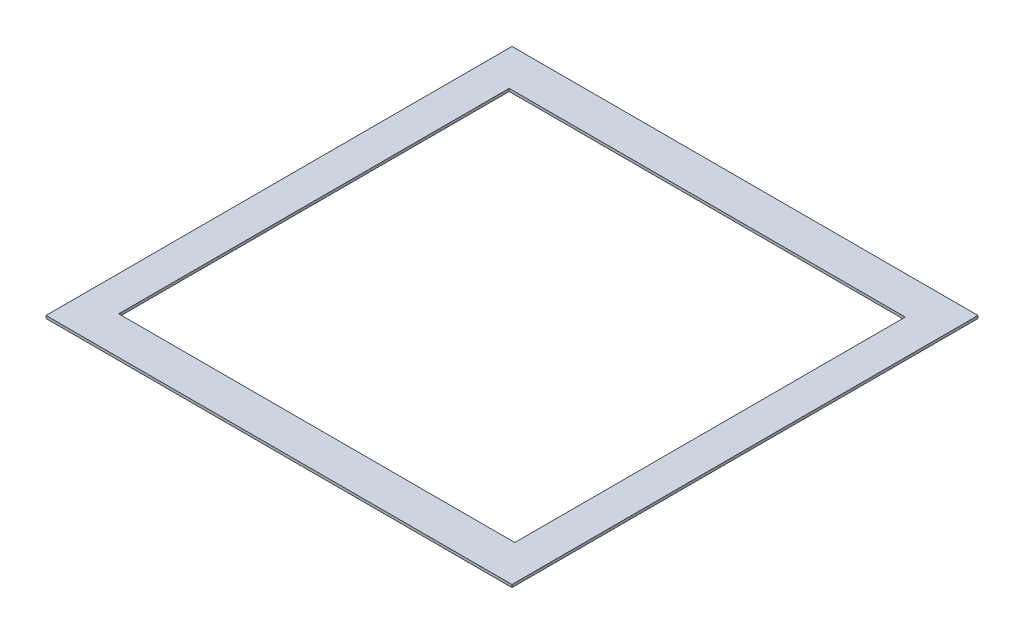
ISO-10303-21;
HEADER;
FILE_DESCRIPTION(('STEP AP214'),'2;1');
FILE_NAME('part.step','',(''),(''),'','','');
FILE_SCHEMA(('AUTOMOTIVE_DESIGN { 1 0 10303 214 1 1 1 1 }'));
ENDSEC;
DATA;
#1=APPLICATION_CONTEXT('core data for automotive mechanical design processes');
#2=APPLICATION_PROTOCOL_DEFINITION('international standard','automotive_design',2000,#1);
#3=PRODUCT_CONTEXT('',#1,'mechanical');
#4=PRODUCT('Part','Part','',(#3));
#5=PRODUCT_RELATED_PRODUCT_CATEGORY('part','',(#4));
#6=PRODUCT_DEFINITION_FORMATION('','',#4);
#7=PRODUCT_DEFINITION_CONTEXT('part definition',#1,'design');
#8=PRODUCT_DEFINITION('design','',#6,#7);
#9=PRODUCT_DEFINITION_SHAPE('','',#8);
#10=(LENGTH_UNIT() NAMED_UNIT(*) SI_UNIT(.MILLI.,.METRE.));
#11=(NAMED_UNIT(*) PLANE_ANGLE_UNIT() SI_UNIT($,.RADIAN.));
#12=(NAMED_UNIT(*) SI_UNIT($,.STERADIAN.) SOLID_ANGLE_UNIT());
#13=UNCERTAINTY_MEASURE_WITH_UNIT(LENGTH_MEASURE(1.E-05),#10,'distance_accuracy_value','');
#14=(GEOMETRIC_REPRESENTATION_CONTEXT(3) GLOBAL_UNCERTAINTY_ASSIGNED_CONTEXT((#13)) GLOBAL_UNIT_ASSIGNED_CONTEXT((#10,
#11,#12)) REPRESENTATION_CONTEXT('',''));
#15=CARTESIAN_POINT('',(0.,0.,0.));
#16=DIRECTION('',(0.,0.,1.));
#17=DIRECTION('',(1.,0.,0.));
#18=AXIS2_PLACEMENT_3D('',#15,#16,#17);
#19=CARTESIAN_POINT('',(0.,15.,0.));
#20=DIRECTION('',(0.,1.,0.));
#21=DIRECTION('',(0.,0.,1.));
#22=AXIS2_PLACEMENT_3D('',#19,#20,#21);
#23=PLANE('',#22);
#24=DIRECTION('',(0.,0.,-1.));
#25=VECTOR('',#24,1.);
#26=CARTESIAN_POINT('',(1278.51296885315,15.,-2321.24151416537));
#27=LINE('',#26,#25);
#28=CARTESIAN_POINT('',(1278.51296885315,15.,278.758485834634));
#29=VERTEX_POINT('',#28);
#30=CARTESIAN_POINT('',(1278.51296885315,15.,-2321.24151416537));
#31=VERTEX_POINT('',#30);
#32=EDGE_CURVE('E137',#29,#31,#27,.T.);
#33=ORIENTED_EDGE('',*,*,#32,.T.);
#34=DIRECTION('',(-1.,0.,0.));
#35=VECTOR('',#34,1.);
#36=CARTESIAN_POINT('',(-1321.48703114685,15.,-2321.24151416537));
#37=LINE('',#36,#35);
#38=CARTESIAN_POINT('',(-1321.48703114685,15.,-2321.24151416537));
#39=VERTEX_POINT('',#38);
#40=EDGE_CURVE('E140',#31,#39,#37,.T.);
#41=ORIENTED_EDGE('',*,*,#40,.T.);
#42=DIRECTION('',(0.,0.,1.));
#43=VECTOR('',#42,1.);
#44=CARTESIAN_POINT('',(-1321.48703114685,15.,-2321.24151416537));
#45=LINE('',#44,#43);
#46=CARTESIAN_POINT('',(-1321.48703114685,15.,278.758485834634));
#47=VERTEX_POINT('',#46);
#48=EDGE_CURVE('E143',#39,#47,#45,.T.);
#49=ORIENTED_EDGE('',*,*,#48,.T.);
#50=DIRECTION('',(1.,0.,0.));
#51=VECTOR('',#50,1.);
#52=CARTESIAN_POINT('',(-1321.48703114685,15.,278.758485834634));
#53=LINE('',#52,#51);
#54=EDGE_CURVE('E145',#47,#29,#53,.T.);
#55=ORIENTED_EDGE('',*,*,#54,.T.);
#56=EDGE_LOOP('',(#33,#41,#49,#55));
#57=FACE_BOUND('',#56,.T.);
#58=DIRECTION('',(1.,0.,0.));
#59=VECTOR('',#58,1.);
#60=CARTESIAN_POINT('',(1083.49575601553,15.,68.087029946589));
#61=LINE('',#60,#59);
#62=CARTESIAN_POINT('',(-1126.46981830923,15.,68.0870299465877));
#63=VERTEX_POINT('',#62);
#64=CARTESIAN_POINT('',(1083.49575601553,15.,68.087029946589));
#65=VERTEX_POINT('',#64);
#66=EDGE_CURVE('E109',#63,#65,#61,.T.);
#67=ORIENTED_EDGE('',*,*,#66,.F.);
#68=DIRECTION('',(0.,0.,1.));
#69=VECTOR('',#68,1.);
#70=CARTESIAN_POINT('',(-1126.46981830923,15.,68.0870299465877));
#71=LINE('',#70,#69);
#72=CARTESIAN_POINT('',(-1126.46981830923,15.,-2110.57005827732));
#73=VERTEX_POINT('',#72);
#74=EDGE_CURVE('E101',#73,#63,#71,.T.);
#75=ORIENTED_EDGE('',*,*,#74,.F.);
#76=DIRECTION('',(-1.,0.,0.));
#77=VECTOR('',#76,1.);
#78=CARTESIAN_POINT('',(-1126.46981830923,15.,-2110.57005827732));
#79=LINE('',#78,#77);
#80=CARTESIAN_POINT('',(1083.49575601553,15.,-2110.57005827732));
#81=VERTEX_POINT('',#80);
#82=EDGE_CURVE('E123',#81,#73,#79,.T.);
#83=ORIENTED_EDGE('',*,*,#82,.F.);
#84=DIRECTION('',(0.,0.,-1.));
#85=VECTOR('',#84,1.);
#86=CARTESIAN_POINT('',(1083.49575601553,15.,-2110.57005827732));
#87=LINE('',#86,#85);
#88=EDGE_CURVE('E121',#65,#81,#87,.T.);
#89=ORIENTED_EDGE('',*,*,#88,.F.);
#90=EDGE_LOOP('',(#67,#75,#83,#89));
#91=FACE_BOUND('',#90,.T.);
#92=ADVANCED_FACE('F36',(#57,#91),#23,.T.);
#93=CARTESIAN_POINT('',(0.,0.,0.));
#94=DIRECTION('',(0.,1.,0.));
#95=DIRECTION('',(0.,0.,1.));
#96=AXIS2_PLACEMENT_3D('',#93,#94,#95);
#97=PLANE('',#96);
#98=DIRECTION('',(0.,0.,-1.));
#99=VECTOR('',#98,1.);
#100=CARTESIAN_POINT('',(1278.51296885315,0.,-2321.24151416537));
#101=LINE('',#100,#99);
#102=CARTESIAN_POINT('',(1278.51296885315,0.,278.758485834634));
#103=VERTEX_POINT('',#102);
#104=CARTESIAN_POINT('',(1278.51296885315,0.,-2321.24151416537));
#105=VERTEX_POINT('',#104);
#106=EDGE_CURVE('E117',#103,#105,#101,.T.);
#107=ORIENTED_EDGE('',*,*,#106,.F.);
#108=DIRECTION('',(1.,0.,0.));
#109=VECTOR('',#108,1.);
#110=CARTESIAN_POINT('',(-1321.48703114685,0.,278.758485834634));
#111=LINE('',#110,#109);
#112=CARTESIAN_POINT('',(-1321.48703114685,0.,278.758485834634));
#113=VERTEX_POINT('',#112);
#114=EDGE_CURVE('E141',#113,#103,#111,.T.);
#115=ORIENTED_EDGE('',*,*,#114,.F.);
#116=DIRECTION('',(0.,0.,1.));
#117=VECTOR('',#116,1.);
#118=CARTESIAN_POINT('',(-1321.48703114685,0.,-2321.24151416537));
#119=LINE('',#118,#117);
#120=CARTESIAN_POINT('',(-1321.48703114685,0.,-2321.24151416537));
#121=VERTEX_POINT('',#120);
#122=EDGE_CURVE('E152',#121,#113,#119,.T.);
#123=ORIENTED_EDGE('',*,*,#122,.F.);
#124=DIRECTION('',(-1.,0.,0.));
#125=VECTOR('',#124,1.);
#126=CARTESIAN_POINT('',(-1321.48703114685,0.,-2321.24151416537));
#127=LINE('',#126,#125);
#128=EDGE_CURVE('E150',#105,#121,#127,.T.);
#129=ORIENTED_EDGE('',*,*,#128,.F.);
#130=EDGE_LOOP('',(#107,#115,#123,#129));
#131=FACE_BOUND('',#130,.T.);
#132=DIRECTION('',(0.,0.,1.));
#133=VECTOR('',#132,1.);
#134=CARTESIAN_POINT('',(-1126.46981830923,0.,68.0870299465877));
#135=LINE('',#134,#133);
#136=CARTESIAN_POINT('',(-1126.46981830923,0.,-2110.57005827732));
#137=VERTEX_POINT('',#136);
#138=CARTESIAN_POINT('',(-1126.46981830923,0.,68.0870299465877));
#139=VERTEX_POINT('',#138);
#140=EDGE_CURVE('E59',#137,#139,#135,.T.);
#141=ORIENTED_EDGE('',*,*,#140,.T.);
#142=DIRECTION('',(1.,0.,0.));
#143=VECTOR('',#142,1.);
#144=CARTESIAN_POINT('',(1083.49575601553,0.,68.087029946589));
#145=LINE('',#144,#143);
#146=CARTESIAN_POINT('',(1083.49575601553,0.,68.087029946589));
#147=VERTEX_POINT('',#146);
#148=EDGE_CURVE('E116',#139,#147,#145,.T.);
#149=ORIENTED_EDGE('',*,*,#148,.T.);
#150=DIRECTION('',(0.,0.,-1.));
#151=VECTOR('',#150,1.);
#152=CARTESIAN_POINT('',(1083.49575601553,0.,-2110.57005827732));
#153=LINE('',#152,#151);
#154=CARTESIAN_POINT('',(1083.49575601553,0.,-2110.57005827732));
#155=VERTEX_POINT('',#154);
#156=EDGE_CURVE('E129',#147,#155,#153,.T.);
#157=ORIENTED_EDGE('',*,*,#156,.T.);
#158=DIRECTION('',(-1.,0.,0.));
#159=VECTOR('',#158,1.);
#160=CARTESIAN_POINT('',(-1126.46981830923,0.,-2110.57005827732));
#161=LINE('',#160,#159);
#162=EDGE_CURVE('E110',#155,#137,#161,.T.);
#163=ORIENTED_EDGE('',*,*,#162,.T.);
#164=EDGE_LOOP('',(#141,#149,#157,#163));
#165=FACE_BOUND('',#164,.T.);
#166=ADVANCED_FACE('F170',(#131,#165),#97,.F.);
#167=CARTESIAN_POINT('',(1278.51296885315,15.,-2321.24151416537));
#168=DIRECTION('',(-1.,0.,0.));
#169=DIRECTION('',(0.,0.,1.));
#170=AXIS2_PLACEMENT_3D('',#167,#168,#169);
#171=PLANE('',#170);
#172=ORIENTED_EDGE('',*,*,#106,.T.);
#173=DIRECTION('',(0.,-1.,0.));
#174=VECTOR('',#173,1.);
#175=CARTESIAN_POINT('',(1278.51296885315,15.,-2321.24151416537));
#176=LINE('',#175,#174);
#177=EDGE_CURVE('E11',#31,#105,#176,.T.);
#178=ORIENTED_EDGE('',*,*,#177,.F.);
#179=ORIENTED_EDGE('',*,*,#32,.F.);
#180=DIRECTION('',(0.,-1.,0.));
#181=VECTOR('',#180,1.);
#182=CARTESIAN_POINT('',(1278.51296885315,15.,278.758485834634));
#183=LINE('',#182,#181);
#184=EDGE_CURVE('E147',#29,#103,#183,.T.);
#185=ORIENTED_EDGE('',*,*,#184,.T.);
#186=EDGE_LOOP('',(#172,#178,#179,#185));
#187=FACE_BOUND('',#186,.T.);
#188=ADVANCED_FACE('F38',(#187),#171,.F.);
#189=CARTESIAN_POINT('',(-1321.48703114685,15.,-2321.24151416537));
#190=DIRECTION('',(0.,0.,1.));
#191=DIRECTION('',(1.,0.,0.));
#192=AXIS2_PLACEMENT_3D('',#189,#190,#191);
#193=PLANE('',#192);
#194=ORIENTED_EDGE('',*,*,#128,.T.);
#195=DIRECTION('',(0.,-1.,0.));
#196=VECTOR('',#195,1.);
#197=CARTESIAN_POINT('',(-1321.48703114685,15.,-2321.24151416537));
#198=LINE('',#197,#196);
#199=EDGE_CURVE('E44',#39,#121,#198,.T.);
#200=ORIENTED_EDGE('',*,*,#199,.F.);
#201=ORIENTED_EDGE('',*,*,#40,.F.);
#202=ORIENTED_EDGE('',*,*,#177,.T.);
#203=EDGE_LOOP('',(#194,#200,#201,#202));
#204=FACE_BOUND('',#203,.T.);
#205=ADVANCED_FACE('F180',(#204),#193,.F.);
#206=CARTESIAN_POINT('',(-1321.48703114685,15.,-2321.24151416537));
#207=DIRECTION('',(1.,0.,0.));
#208=DIRECTION('',(0.,0.,-1.));
#209=AXIS2_PLACEMENT_3D('',#206,#207,#208);
#210=PLANE('',#209);
#211=ORIENTED_EDGE('',*,*,#122,.T.);
#212=DIRECTION('',(0.,-1.,0.));
#213=VECTOR('',#212,1.);
#214=CARTESIAN_POINT('',(-1321.48703114685,15.,278.758485834634));
#215=LINE('',#214,#213);
#216=EDGE_CURVE('E157',#47,#113,#215,.T.);
#217=ORIENTED_EDGE('',*,*,#216,.F.);
#218=ORIENTED_EDGE('',*,*,#48,.F.);
#219=ORIENTED_EDGE('',*,*,#199,.T.);
#220=EDGE_LOOP('',(#211,#217,#218,#219));
#221=FACE_BOUND('',#220,.T.);
#222=ADVANCED_FACE('F164',(#221),#210,.F.);
#223=CARTESIAN_POINT('',(-1321.48703114685,15.,278.758485834634));
#224=DIRECTION('',(0.,0.,-1.));
#225=DIRECTION('',(-1.,0.,0.));
#226=AXIS2_PLACEMENT_3D('',#223,#224,#225);
#227=PLANE('',#226);
#228=ORIENTED_EDGE('',*,*,#114,.T.);
#229=ORIENTED_EDGE('',*,*,#184,.F.);
#230=ORIENTED_EDGE('',*,*,#54,.F.);
#231=ORIENTED_EDGE('',*,*,#216,.T.);
#232=EDGE_LOOP('',(#228,#229,#230,#231));
#233=FACE_BOUND('',#232,.T.);
#234=ADVANCED_FACE('F174',(#233),#227,.F.);
#235=CARTESIAN_POINT('',(-1126.46981830923,15.,68.0870299465877));
#236=DIRECTION('',(1.,0.,0.));
#237=DIRECTION('',(0.,0.,-1.));
#238=AXIS2_PLACEMENT_3D('',#235,#236,#237);
#239=PLANE('',#238);
#240=ORIENTED_EDGE('',*,*,#140,.F.);
#241=DIRECTION('',(0.,-1.,0.));
#242=VECTOR('',#241,1.);
#243=CARTESIAN_POINT('',(-1126.46981830923,15.,-2110.57005827732));
#244=LINE('',#243,#242);
#245=EDGE_CURVE('E105',#73,#137,#244,.T.);
#246=ORIENTED_EDGE('',*,*,#245,.F.);
#247=ORIENTED_EDGE('',*,*,#74,.T.);
#248=DIRECTION('',(0.,-1.,0.));
#249=VECTOR('',#248,1.);
#250=CARTESIAN_POINT('',(-1126.46981830923,15.,68.0870299465877));
#251=LINE('',#250,#249);
#252=EDGE_CURVE('E104',#63,#139,#251,.T.);
#253=ORIENTED_EDGE('',*,*,#252,.T.);
#254=EDGE_LOOP('',(#240,#246,#247,#253));
#255=FACE_BOUND('',#254,.T.);
#256=ADVANCED_FACE('F103',(#255),#239,.T.);
#257=CARTESIAN_POINT('',(1083.49575601553,15.,68.087029946589));
#258=DIRECTION('',(0.,0.,-1.));
#259=DIRECTION('',(-1.,0.,0.));
#260=AXIS2_PLACEMENT_3D('',#257,#258,#259);
#261=PLANE('',#260);
#262=ORIENTED_EDGE('',*,*,#148,.F.);
#263=ORIENTED_EDGE('',*,*,#252,.F.);
#264=ORIENTED_EDGE('',*,*,#66,.T.);
#265=DIRECTION('',(0.,-1.,0.));
#266=VECTOR('',#265,1.);
#267=CARTESIAN_POINT('',(1083.49575601553,15.,68.087029946589));
#268=LINE('',#267,#266);
#269=EDGE_CURVE('E118',#65,#147,#268,.T.);
#270=ORIENTED_EDGE('',*,*,#269,.T.);
#271=EDGE_LOOP('',(#262,#263,#264,#270));
#272=FACE_BOUND('',#271,.T.);
#273=ADVANCED_FACE('F113',(#272),#261,.T.);
#274=CARTESIAN_POINT('',(1083.49575601553,15.,-2110.57005827732));
#275=DIRECTION('',(-1.,0.,0.));
#276=DIRECTION('',(0.,0.,1.));
#277=AXIS2_PLACEMENT_3D('',#274,#275,#276);
#278=PLANE('',#277);
#279=ORIENTED_EDGE('',*,*,#156,.F.);
#280=ORIENTED_EDGE('',*,*,#269,.F.);
#281=ORIENTED_EDGE('',*,*,#88,.T.);
#282=DIRECTION('',(0.,-1.,0.));
#283=VECTOR('',#282,1.);
#284=CARTESIAN_POINT('',(1083.49575601553,15.,-2110.57005827732));
#285=LINE('',#284,#283);
#286=EDGE_CURVE('E51',#81,#155,#285,.T.);
#287=ORIENTED_EDGE('',*,*,#286,.T.);
#288=EDGE_LOOP('',(#279,#280,#281,#287));
#289=FACE_BOUND('',#288,.T.);
#290=ADVANCED_FACE('F203',(#289),#278,.T.);
#291=CARTESIAN_POINT('',(-1126.46981830923,15.,-2110.57005827732));
#292=DIRECTION('',(0.,0.,1.));
#293=DIRECTION('',(1.,0.,0.));
#294=AXIS2_PLACEMENT_3D('',#291,#292,#293);
#295=PLANE('',#294);
#296=ORIENTED_EDGE('',*,*,#162,.F.);
#297=ORIENTED_EDGE('',*,*,#286,.F.);
#298=ORIENTED_EDGE('',*,*,#82,.T.);
#299=ORIENTED_EDGE('',*,*,#245,.T.);
#300=EDGE_LOOP('',(#296,#297,#298,#299));
#301=FACE_BOUND('',#300,.T.);
#302=ADVANCED_FACE('F207',(#301),#295,.T.);
#303=CLOSED_SHELL('',(#92,#166,#188,#205,#222,#234,#256,#273,#290,#302));
#304=MANIFOLD_SOLID_BREP('B2',#303);
#305=ADVANCED_BREP_SHAPE_REPRESENTATION('',(#18,#304),#14);
#306=SHAPE_DEFINITION_REPRESENTATION(#9,#305);
ENDSEC;
END-ISO-10303-21;
